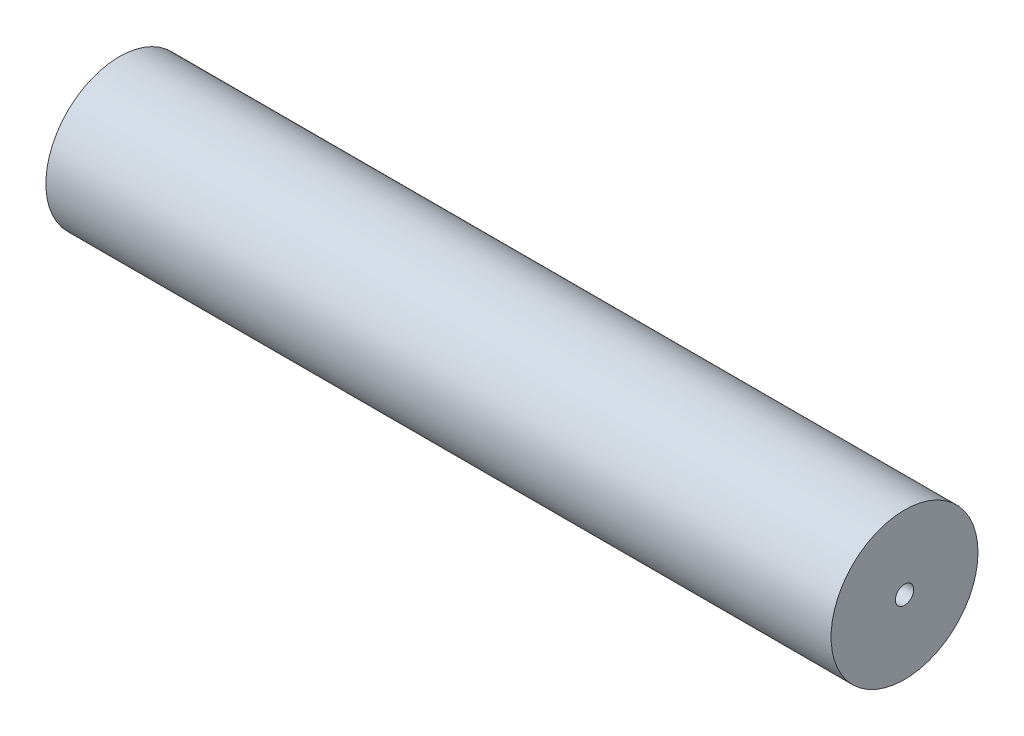
ISO-10303-21;
HEADER;
FILE_DESCRIPTION(('STEP AP214'),'2;1');
FILE_NAME('part.step','',(''),(''),'','','');
FILE_SCHEMA(('AUTOMOTIVE_DESIGN { 1 0 10303 214 1 1 1 1 }'));
ENDSEC;
DATA;
#1=APPLICATION_CONTEXT('core data for automotive mechanical design processes');
#2=APPLICATION_PROTOCOL_DEFINITION('international standard','automotive_design',2000,#1);
#3=PRODUCT_CONTEXT('',#1,'mechanical');
#4=PRODUCT('Part','Part','',(#3));
#5=PRODUCT_RELATED_PRODUCT_CATEGORY('part','',(#4));
#6=PRODUCT_DEFINITION_FORMATION('','',#4);
#7=PRODUCT_DEFINITION_CONTEXT('part definition',#1,'design');
#8=PRODUCT_DEFINITION('design','',#6,#7);
#9=PRODUCT_DEFINITION_SHAPE('','',#8);
#10=(LENGTH_UNIT() NAMED_UNIT(*) SI_UNIT(.MILLI.,.METRE.));
#11=(NAMED_UNIT(*) PLANE_ANGLE_UNIT() SI_UNIT($,.RADIAN.));
#12=(NAMED_UNIT(*) SI_UNIT($,.STERADIAN.) SOLID_ANGLE_UNIT());
#13=UNCERTAINTY_MEASURE_WITH_UNIT(LENGTH_MEASURE(1.E-05),#10,'distance_accuracy_value','');
#14=(GEOMETRIC_REPRESENTATION_CONTEXT(3) GLOBAL_UNCERTAINTY_ASSIGNED_CONTEXT((#13)) GLOBAL_UNIT_ASSIGNED_CONTEXT((#10,
#11,#12)) REPRESENTATION_CONTEXT('',''));
#15=CARTESIAN_POINT('',(0.,0.,0.));
#16=DIRECTION('',(0.,0.,1.));
#17=DIRECTION('',(1.,0.,0.));
#18=AXIS2_PLACEMENT_3D('',#15,#16,#17);
#19=CARTESIAN_POINT('',(271.4625,0.,0.));
#20=DIRECTION('',(-1.,0.,0.));
#21=DIRECTION('',(0.,0.,1.));
#22=AXIS2_PLACEMENT_3D('',#19,#20,#21);
#23=CYLINDRICAL_SURFACE('',#22,50.8);
#24=CARTESIAN_POINT('',(271.4625,0.,0.));
#25=DIRECTION('',(1.,0.,0.));
#26=DIRECTION('',(0.,0.,-1.));
#27=AXIS2_PLACEMENT_3D('',#24,#25,#26);
#28=CIRCLE('',#27,50.8);
#29=CARTESIAN_POINT('',(271.4625,0.,-50.8));
#30=VERTEX_POINT('',#29);
#31=EDGE_CURVE('E10',#30,#30,#28,.T.);
#32=ORIENTED_EDGE('',*,*,#31,.F.);
#33=EDGE_LOOP('',(#32));
#34=FACE_BOUND('',#33,.T.);
#35=CARTESIAN_POINT('',(-271.4625,0.,0.));
#36=DIRECTION('',(1.,0.,0.));
#37=DIRECTION('',(0.,0.,-1.));
#38=AXIS2_PLACEMENT_3D('',#35,#36,#37);
#39=CIRCLE('',#38,50.8);
#40=CARTESIAN_POINT('',(-271.4625,0.,-50.8));
#41=VERTEX_POINT('',#40);
#42=EDGE_CURVE('E34',#41,#41,#39,.T.);
#43=ORIENTED_EDGE('',*,*,#42,.T.);
#44=EDGE_LOOP('',(#43));
#45=FACE_BOUND('',#44,.T.);
#46=ADVANCED_FACE('F31',(#34,#45),#23,.T.);
#47=CARTESIAN_POINT('',(271.4625,0.,0.));
#48=DIRECTION('',(1.,0.,0.));
#49=DIRECTION('',(0.,0.,-1.));
#50=AXIS2_PLACEMENT_3D('',#47,#48,#49);
#51=PLANE('',#50);
#52=CARTESIAN_POINT('',(271.4625,0.,0.));
#53=DIRECTION('',(-1.,0.,0.));
#54=DIRECTION('',(0.,0.,1.));
#55=AXIS2_PLACEMENT_3D('',#52,#53,#54);
#56=CIRCLE('',#55,6.35);
#57=CARTESIAN_POINT('',(271.4625,0.,6.35));
#58=VERTEX_POINT('',#57);
#59=EDGE_CURVE('E41',#58,#58,#56,.T.);
#60=ORIENTED_EDGE('',*,*,#59,.T.);
#61=EDGE_LOOP('',(#60));
#62=FACE_BOUND('',#61,.T.);
#63=ORIENTED_EDGE('',*,*,#31,.T.);
#64=EDGE_LOOP('',(#63));
#65=FACE_BOUND('',#64,.T.);
#66=ADVANCED_FACE('F49',(#62,#65),#51,.T.);
#67=CARTESIAN_POINT('',(-271.4625,0.,0.));
#68=DIRECTION('',(1.,0.,0.));
#69=DIRECTION('',(0.,0.,-1.));
#70=AXIS2_PLACEMENT_3D('',#67,#68,#69);
#71=PLANE('',#70);
#72=CARTESIAN_POINT('',(-271.4625,0.,0.));
#73=DIRECTION('',(-1.,0.,0.));
#74=DIRECTION('',(0.,0.,1.));
#75=AXIS2_PLACEMENT_3D('',#72,#73,#74);
#76=CIRCLE('',#75,6.35);
#77=CARTESIAN_POINT('',(-271.4625,0.,6.35));
#78=VERTEX_POINT('',#77);
#79=EDGE_CURVE('E43',#78,#78,#76,.T.);
#80=ORIENTED_EDGE('',*,*,#79,.F.);
#81=EDGE_LOOP('',(#80));
#82=FACE_BOUND('',#81,.T.);
#83=ORIENTED_EDGE('',*,*,#42,.F.);
#84=EDGE_LOOP('',(#83));
#85=FACE_BOUND('',#84,.T.);
#86=ADVANCED_FACE('F54',(#82,#85),#71,.F.);
#87=CARTESIAN_POINT('',(271.4625,0.,0.));
#88=DIRECTION('',(-1.,0.,0.));
#89=DIRECTION('',(0.,0.,1.));
#90=AXIS2_PLACEMENT_3D('',#87,#88,#89);
#91=CYLINDRICAL_SURFACE('',#90,6.35);
#92=ORIENTED_EDGE('',*,*,#59,.F.);
#93=EDGE_LOOP('',(#92));
#94=FACE_BOUND('',#93,.T.);
#95=ORIENTED_EDGE('',*,*,#79,.T.);
#96=EDGE_LOOP('',(#95));
#97=FACE_BOUND('',#96,.T.);
#98=ADVANCED_FACE('F51',(#94,#97),#91,.F.);
#99=CLOSED_SHELL('',(#46,#66,#86,#98));
#100=MANIFOLD_SOLID_BREP('B2',#99);
#101=ADVANCED_BREP_SHAPE_REPRESENTATION('',(#18,#100),#14);
#102=SHAPE_DEFINITION_REPRESENTATION(#9,#101);
ENDSEC;
END-ISO-10303-21;
